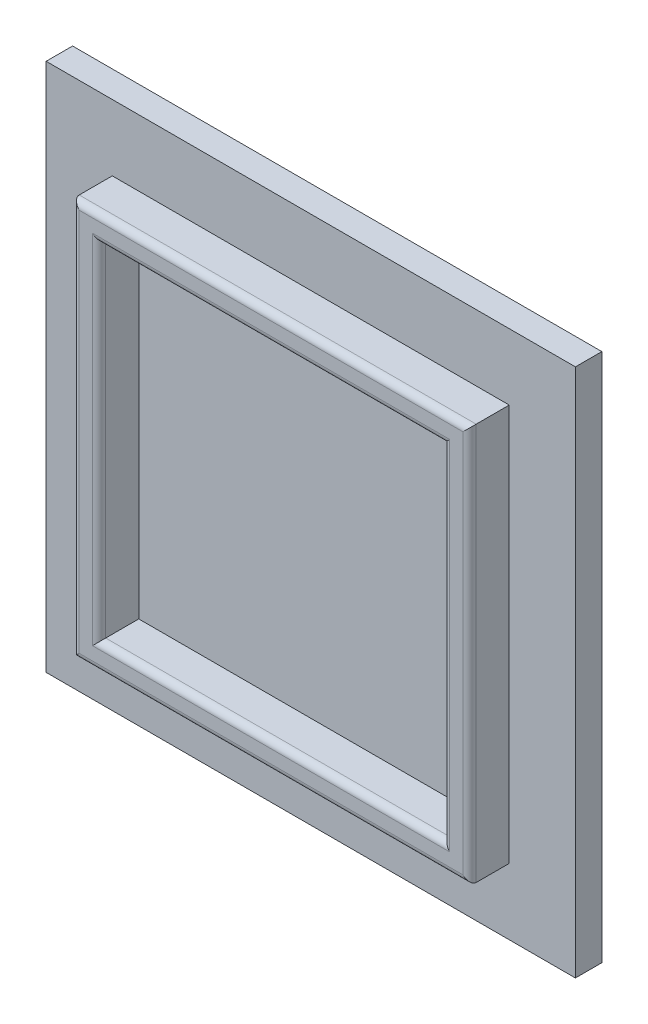
ISO-10303-21;
HEADER;
FILE_DESCRIPTION(('STEP AP214'),'2;1');
FILE_NAME('part.step','',(''),(''),'','','');
FILE_SCHEMA(('AUTOMOTIVE_DESIGN { 1 0 10303 214 1 1 1 1 }'));
ENDSEC;
DATA;
#1=APPLICATION_CONTEXT('core data for automotive mechanical design processes');
#2=APPLICATION_PROTOCOL_DEFINITION('international standard','automotive_design',2000,#1);
#3=PRODUCT_CONTEXT('',#1,'mechanical');
#4=PRODUCT('Part','Part','',(#3));
#5=PRODUCT_RELATED_PRODUCT_CATEGORY('part','',(#4));
#6=PRODUCT_DEFINITION_FORMATION('','',#4);
#7=PRODUCT_DEFINITION_CONTEXT('part definition',#1,'design');
#8=PRODUCT_DEFINITION('design','',#6,#7);
#9=PRODUCT_DEFINITION_SHAPE('','',#8);
#10=(LENGTH_UNIT() NAMED_UNIT(*) SI_UNIT(.MILLI.,.METRE.));
#11=(NAMED_UNIT(*) PLANE_ANGLE_UNIT() SI_UNIT($,.RADIAN.));
#12=(NAMED_UNIT(*) SI_UNIT($,.STERADIAN.) SOLID_ANGLE_UNIT());
#13=UNCERTAINTY_MEASURE_WITH_UNIT(LENGTH_MEASURE(1.E-05),#10,'distance_accuracy_value','');
#14=(GEOMETRIC_REPRESENTATION_CONTEXT(3) GLOBAL_UNCERTAINTY_ASSIGNED_CONTEXT((#13)) GLOBAL_UNIT_ASSIGNED_CONTEXT((#10,
#11,#12)) REPRESENTATION_CONTEXT('',''));
#15=CARTESIAN_POINT('',(0.,0.,0.));
#16=DIRECTION('',(0.,0.,1.));
#17=DIRECTION('',(1.,0.,0.));
#18=AXIS2_PLACEMENT_3D('',#15,#16,#17);
#19=CARTESIAN_POINT('',(0.,0.,2.));
#20=DIRECTION('',(0.,0.,1.));
#21=DIRECTION('',(1.,0.,0.));
#22=AXIS2_PLACEMENT_3D('',#19,#20,#21);
#23=PLANE('',#22);
#24=DIRECTION('',(0.,-1.,0.));
#25=VECTOR('',#24,1.);
#26=CARTESIAN_POINT('',(-25.1923076923077,15.1442307692308,2.));
#27=LINE('',#26,#25);
#28=CARTESIAN_POINT('',(-25.1923076923077,15.1442307692308,2.));
#29=VERTEX_POINT('',#28);
#30=CARTESIAN_POINT('',(-25.1923076923077,-24.8557692307692,2.));
#31=VERTEX_POINT('',#30);
#32=EDGE_CURVE('E217',#29,#31,#27,.T.);
#33=ORIENTED_EDGE('',*,*,#32,.T.);
#34=DIRECTION('',(1.,0.,0.));
#35=VECTOR('',#34,1.);
#36=CARTESIAN_POINT('',(-25.1923076923077,-24.8557692307692,2.));
#37=LINE('',#36,#35);
#38=CARTESIAN_POINT('',(14.8076923076923,-24.8557692307692,2.));
#39=VERTEX_POINT('',#38);
#40=EDGE_CURVE('E221',#31,#39,#37,.T.);
#41=ORIENTED_EDGE('',*,*,#40,.T.);
#42=DIRECTION('',(0.,1.,0.));
#43=VECTOR('',#42,1.);
#44=CARTESIAN_POINT('',(14.8076923076923,15.1442307692308,2.));
#45=LINE('',#44,#43);
#46=CARTESIAN_POINT('',(14.8076923076923,15.1442307692308,2.));
#47=VERTEX_POINT('',#46);
#48=EDGE_CURVE('E225',#39,#47,#45,.T.);
#49=ORIENTED_EDGE('',*,*,#48,.T.);
#50=DIRECTION('',(-1.,0.,0.));
#51=VECTOR('',#50,1.);
#52=CARTESIAN_POINT('',(-25.1923076923077,15.1442307692308,2.));
#53=LINE('',#52,#51);
#54=EDGE_CURVE('E228',#47,#29,#53,.T.);
#55=ORIENTED_EDGE('',*,*,#54,.T.);
#56=EDGE_LOOP('',(#33,#41,#49,#55));
#57=FACE_BOUND('',#56,.T.);
#58=DIRECTION('',(1.,0.,0.));
#59=VECTOR('',#58,1.);
#60=CARTESIAN_POINT('',(9.80769230769232,-19.8557692307691,2.));
#61=LINE('',#60,#59);
#62=CARTESIAN_POINT('',(-20.1923076923077,-19.8557692307691,2.));
#63=VERTEX_POINT('',#62);
#64=CARTESIAN_POINT('',(9.80769230769232,-19.8557692307691,2.));
#65=VERTEX_POINT('',#64);
#66=EDGE_CURVE('E192',#63,#65,#61,.T.);
#67=ORIENTED_EDGE('',*,*,#66,.F.);
#68=DIRECTION('',(0.,-1.,0.));
#69=VECTOR('',#68,1.);
#70=CARTESIAN_POINT('',(-20.1923076923077,-19.8557692307691,2.));
#71=LINE('',#70,#69);
#72=CARTESIAN_POINT('',(-20.1923076923077,10.1442307692307,2.));
#73=VERTEX_POINT('',#72);
#74=EDGE_CURVE('E188',#73,#63,#71,.T.);
#75=ORIENTED_EDGE('',*,*,#74,.F.);
#76=DIRECTION('',(-1.,0.,0.));
#77=VECTOR('',#76,1.);
#78=CARTESIAN_POINT('',(9.80769230769232,10.1442307692307,2.));
#79=LINE('',#78,#77);
#80=CARTESIAN_POINT('',(9.80769230769232,10.1442307692307,2.));
#81=VERTEX_POINT('',#80);
#82=EDGE_CURVE('E200',#81,#73,#79,.T.);
#83=ORIENTED_EDGE('',*,*,#82,.F.);
#84=DIRECTION('',(0.,1.,0.));
#85=VECTOR('',#84,1.);
#86=CARTESIAN_POINT('',(9.80769230769232,-19.8557692307691,2.));
#87=LINE('',#86,#85);
#88=EDGE_CURVE('E196',#65,#81,#87,.T.);
#89=ORIENTED_EDGE('',*,*,#88,.F.);
#90=EDGE_LOOP('',(#67,#75,#83,#89));
#91=FACE_BOUND('',#90,.T.);
#92=ADVANCED_FACE('F38',(#57,#91),#23,.T.);
#93=CARTESIAN_POINT('',(-25.1923076923077,15.1442307692308,2.));
#94=DIRECTION('',(1.,0.,0.));
#95=DIRECTION('',(0.,1.,0.));
#96=AXIS2_PLACEMENT_3D('',#93,#94,#95);
#97=PLANE('',#96);
#98=DIRECTION('',(0.,-1.,0.));
#99=VECTOR('',#98,1.);
#100=CARTESIAN_POINT('',(-25.1923076923077,15.1442307692308,0.));
#101=LINE('',#100,#99);
#102=CARTESIAN_POINT('',(-25.1923076923077,15.1442307692308,0.));
#103=VERTEX_POINT('',#102);
#104=CARTESIAN_POINT('',(-25.1923076923077,-24.8557692307692,0.));
#105=VERTEX_POINT('',#104);
#106=EDGE_CURVE('E216',#103,#105,#101,.T.);
#107=ORIENTED_EDGE('',*,*,#106,.T.);
#108=DIRECTION('',(0.,0.,-1.));
#109=VECTOR('',#108,1.);
#110=CARTESIAN_POINT('',(-25.1923076923077,-24.8557692307692,2.));
#111=LINE('',#110,#109);
#112=EDGE_CURVE('E254',#31,#105,#111,.T.);
#113=ORIENTED_EDGE('',*,*,#112,.F.);
#114=ORIENTED_EDGE('',*,*,#32,.F.);
#115=DIRECTION('',(0.,0.,-1.));
#116=VECTOR('',#115,1.);
#117=CARTESIAN_POINT('',(-25.1923076923077,15.1442307692308,2.));
#118=LINE('',#117,#116);
#119=EDGE_CURVE('E231',#29,#103,#118,.T.);
#120=ORIENTED_EDGE('',*,*,#119,.T.);
#121=EDGE_LOOP('',(#107,#113,#114,#120));
#122=FACE_BOUND('',#121,.T.);
#123=ADVANCED_FACE('F370',(#122),#97,.F.);
#124=CARTESIAN_POINT('',(-25.1923076923077,-24.8557692307692,2.));
#125=DIRECTION('',(0.,1.,0.));
#126=DIRECTION('',(0.,0.,1.));
#127=AXIS2_PLACEMENT_3D('',#124,#125,#126);
#128=PLANE('',#127);
#129=DIRECTION('',(1.,0.,0.));
#130=VECTOR('',#129,1.);
#131=CARTESIAN_POINT('',(-25.1923076923077,-24.8557692307692,0.));
#132=LINE('',#131,#130);
#133=CARTESIAN_POINT('',(14.8076923076923,-24.8557692307692,0.));
#134=VERTEX_POINT('',#133);
#135=EDGE_CURVE('E235',#105,#134,#132,.T.);
#136=ORIENTED_EDGE('',*,*,#135,.T.);
#137=DIRECTION('',(0.,0.,-1.));
#138=VECTOR('',#137,1.);
#139=CARTESIAN_POINT('',(14.8076923076923,-24.8557692307692,2.));
#140=LINE('',#139,#138);
#141=EDGE_CURVE('E250',#39,#134,#140,.T.);
#142=ORIENTED_EDGE('',*,*,#141,.F.);
#143=ORIENTED_EDGE('',*,*,#40,.F.);
#144=ORIENTED_EDGE('',*,*,#112,.T.);
#145=EDGE_LOOP('',(#136,#142,#143,#144));
#146=FACE_BOUND('',#145,.T.);
#147=ADVANCED_FACE('F378',(#146),#128,.F.);
#148=CARTESIAN_POINT('',(14.8076923076923,15.1442307692308,2.));
#149=DIRECTION('',(-1.,0.,0.));
#150=DIRECTION('',(0.,-1.,0.));
#151=AXIS2_PLACEMENT_3D('',#148,#149,#150);
#152=PLANE('',#151);
#153=DIRECTION('',(0.,1.,0.));
#154=VECTOR('',#153,1.);
#155=CARTESIAN_POINT('',(14.8076923076923,15.1442307692308,0.));
#156=LINE('',#155,#154);
#157=CARTESIAN_POINT('',(14.8076923076923,15.1442307692308,0.));
#158=VERTEX_POINT('',#157);
#159=EDGE_CURVE('E238',#134,#158,#156,.T.);
#160=ORIENTED_EDGE('',*,*,#159,.T.);
#161=DIRECTION('',(0.,0.,-1.));
#162=VECTOR('',#161,1.);
#163=CARTESIAN_POINT('',(14.8076923076923,15.1442307692308,2.));
#164=LINE('',#163,#162);
#165=EDGE_CURVE('E246',#47,#158,#164,.T.);
#166=ORIENTED_EDGE('',*,*,#165,.F.);
#167=ORIENTED_EDGE('',*,*,#48,.F.);
#168=ORIENTED_EDGE('',*,*,#141,.T.);
#169=EDGE_LOOP('',(#160,#166,#167,#168));
#170=FACE_BOUND('',#169,.T.);
#171=ADVANCED_FACE('F472',(#170),#152,.F.);
#172=CARTESIAN_POINT('',(-25.1923076923077,15.1442307692308,2.));
#173=DIRECTION('',(0.,-1.,0.));
#174=DIRECTION('',(0.,0.,-1.));
#175=AXIS2_PLACEMENT_3D('',#172,#173,#174);
#176=PLANE('',#175);
#177=DIRECTION('',(-1.,0.,0.));
#178=VECTOR('',#177,1.);
#179=CARTESIAN_POINT('',(-25.1923076923077,15.1442307692308,0.));
#180=LINE('',#179,#178);
#181=EDGE_CURVE('E222',#158,#103,#180,.T.);
#182=ORIENTED_EDGE('',*,*,#181,.T.);
#183=ORIENTED_EDGE('',*,*,#119,.F.);
#184=ORIENTED_EDGE('',*,*,#54,.F.);
#185=ORIENTED_EDGE('',*,*,#165,.T.);
#186=EDGE_LOOP('',(#182,#183,#184,#185));
#187=FACE_BOUND('',#186,.T.);
#188=ADVANCED_FACE('F460',(#187),#176,.F.);
#189=CARTESIAN_POINT('',(0.,0.,0.));
#190=DIRECTION('',(0.,0.,1.));
#191=DIRECTION('',(1.,0.,0.));
#192=AXIS2_PLACEMENT_3D('',#189,#190,#191);
#193=PLANE('',#192);
#194=ORIENTED_EDGE('',*,*,#106,.F.);
#195=ORIENTED_EDGE('',*,*,#181,.F.);
#196=ORIENTED_EDGE('',*,*,#159,.F.);
#197=ORIENTED_EDGE('',*,*,#135,.F.);
#198=EDGE_LOOP('',(#194,#195,#196,#197));
#199=FACE_BOUND('',#198,.T.);
#200=ADVANCED_FACE('F449',(#199),#193,.F.);
#201=CARTESIAN_POINT('',(0.,0.,5.));
#202=DIRECTION('',(0.,0.,1.));
#203=DIRECTION('',(1.,0.,0.));
#204=AXIS2_PLACEMENT_3D('',#201,#202,#203);
#205=PLANE('',#204);
#206=DIRECTION('',(0.,1.,0.));
#207=VECTOR('',#206,1.);
#208=CARTESIAN_POINT('',(8.3076923076923,0.,5.));
#209=LINE('',#208,#207);
#210=CARTESIAN_POINT('',(8.3076923076923,8.64423076923077,5.));
#211=VERTEX_POINT('',#210);
#212=CARTESIAN_POINT('',(8.3076923076923,-18.3557692307692,5.));
#213=VERTEX_POINT('',#212);
#214=EDGE_CURVE('E277',#211,#213,#209,.F.);
#215=ORIENTED_EDGE('',*,*,#214,.T.);
#216=DIRECTION('',(1.,0.,0.));
#217=VECTOR('',#216,1.);
#218=CARTESIAN_POINT('',(0.,-18.3557692307692,5.));
#219=LINE('',#218,#217);
#220=CARTESIAN_POINT('',(-18.6923076923077,-18.3557692307692,5.));
#221=VERTEX_POINT('',#220);
#222=EDGE_CURVE('E280',#213,#221,#219,.F.);
#223=ORIENTED_EDGE('',*,*,#222,.T.);
#224=DIRECTION('',(0.,-1.,0.));
#225=VECTOR('',#224,1.);
#226=CARTESIAN_POINT('',(-18.6923076923077,0.,5.));
#227=LINE('',#226,#225);
#228=CARTESIAN_POINT('',(-18.6923076923077,8.64423076923077,5.));
#229=VERTEX_POINT('',#228);
#230=EDGE_CURVE('E274',#221,#229,#227,.F.);
#231=ORIENTED_EDGE('',*,*,#230,.T.);
#232=DIRECTION('',(-1.,0.,0.));
#233=VECTOR('',#232,1.);
#234=CARTESIAN_POINT('',(0.,8.64423076923077,5.));
#235=LINE('',#234,#233);
#236=EDGE_CURVE('E271',#229,#211,#235,.F.);
#237=ORIENTED_EDGE('',*,*,#236,.T.);
#238=EDGE_LOOP('',(#215,#223,#231,#237));
#239=FACE_BOUND('',#238,.T.);
#240=DIRECTION('',(0.,-1.,0.));
#241=VECTOR('',#240,1.);
#242=CARTESIAN_POINT('',(-19.6923076923077,-19.8557692307691,5.));
#243=LINE('',#242,#241);
#244=CARTESIAN_POINT('',(-19.6923076923077,9.6442307692307,5.));
#245=VERTEX_POINT('',#244);
#246=CARTESIAN_POINT('',(-19.6923076923077,-19.3557692307691,5.));
#247=VERTEX_POINT('',#246);
#248=EDGE_CURVE('E258',#245,#247,#243,.T.);
#249=ORIENTED_EDGE('',*,*,#248,.T.);
#250=DIRECTION('',(1.,0.,0.));
#251=VECTOR('',#250,1.);
#252=CARTESIAN_POINT('',(9.80769230769232,-19.3557692307691,5.));
#253=LINE('',#252,#251);
#254=CARTESIAN_POINT('',(9.30769230769232,-19.3557692307691,5.));
#255=VERTEX_POINT('',#254);
#256=EDGE_CURVE('E267',#247,#255,#253,.T.);
#257=ORIENTED_EDGE('',*,*,#256,.T.);
#258=DIRECTION('',(0.,1.,0.));
#259=VECTOR('',#258,1.);
#260=CARTESIAN_POINT('',(9.30769230769232,10.1442307692307,5.));
#261=LINE('',#260,#259);
#262=CARTESIAN_POINT('',(9.30769230769232,9.64423076923069,5.));
#263=VERTEX_POINT('',#262);
#264=EDGE_CURVE('E264',#255,#263,#261,.T.);
#265=ORIENTED_EDGE('',*,*,#264,.T.);
#266=DIRECTION('',(-1.,0.,0.));
#267=VECTOR('',#266,1.);
#268=CARTESIAN_POINT('',(-20.1923076923077,9.6442307692307,5.));
#269=LINE('',#268,#267);
#270=EDGE_CURVE('E261',#263,#245,#269,.T.);
#271=ORIENTED_EDGE('',*,*,#270,.T.);
#272=EDGE_LOOP('',(#249,#257,#265,#271));
#273=FACE_BOUND('',#272,.T.);
#274=ADVANCED_FACE('F341',(#239,#273),#205,.T.);
#275=CARTESIAN_POINT('',(-20.1923076923077,-19.8557692307691,5.));
#276=DIRECTION('',(1.,0.,0.));
#277=DIRECTION('',(0.,1.,0.));
#278=AXIS2_PLACEMENT_3D('',#275,#276,#277);
#279=PLANE('',#278);
#280=DIRECTION('',(0.,0.,-1.));
#281=VECTOR('',#280,1.);
#282=CARTESIAN_POINT('',(-20.1923076923077,-19.8557692307691,5.));
#283=LINE('',#282,#281);
#284=CARTESIAN_POINT('',(-20.1923076923077,-19.8557692307691,4.5));
#285=VERTEX_POINT('',#284);
#286=EDGE_CURVE('E213',#285,#63,#283,.T.);
#287=ORIENTED_EDGE('',*,*,#286,.F.);
#288=DIRECTION('',(0.,-1.,0.));
#289=VECTOR('',#288,1.);
#290=CARTESIAN_POINT('',(-20.1923076923077,10.1442307692307,4.5));
#291=LINE('',#290,#289);
#292=CARTESIAN_POINT('',(-20.1923076923077,10.1442307692307,4.5));
#293=VERTEX_POINT('',#292);
#294=EDGE_CURVE('E11',#285,#293,#291,.F.);
#295=ORIENTED_EDGE('',*,*,#294,.T.);
#296=DIRECTION('',(0.,0.,-1.));
#297=VECTOR('',#296,1.);
#298=CARTESIAN_POINT('',(-20.1923076923077,10.1442307692307,5.));
#299=LINE('',#298,#297);
#300=EDGE_CURVE('E204',#293,#73,#299,.T.);
#301=ORIENTED_EDGE('',*,*,#300,.T.);
#302=ORIENTED_EDGE('',*,*,#74,.T.);
#303=EDGE_LOOP('',(#287,#295,#301,#302));
#304=FACE_BOUND('',#303,.T.);
#305=ADVANCED_FACE('F434',(#304),#279,.F.);
#306=CARTESIAN_POINT('',(9.80769230769232,-19.8557692307691,5.));
#307=DIRECTION('',(0.,1.,0.));
#308=DIRECTION('',(-1.,0.,0.));
#309=AXIS2_PLACEMENT_3D('',#306,#307,#308);
#310=PLANE('',#309);
#311=DIRECTION('',(0.,0.,-1.));
#312=VECTOR('',#311,1.);
#313=CARTESIAN_POINT('',(9.80769230769232,-19.8557692307691,5.));
#314=LINE('',#313,#312);
#315=CARTESIAN_POINT('',(9.80769230769232,-19.8557692307691,4.5));
#316=VERTEX_POINT('',#315);
#317=EDGE_CURVE('E210',#316,#65,#314,.T.);
#318=ORIENTED_EDGE('',*,*,#317,.F.);
#319=DIRECTION('',(1.,0.,0.));
#320=VECTOR('',#319,1.);
#321=CARTESIAN_POINT('',(-20.1923076923077,-19.8557692307691,4.5));
#322=LINE('',#321,#320);
#323=EDGE_CURVE('E284',#316,#285,#322,.F.);
#324=ORIENTED_EDGE('',*,*,#323,.T.);
#325=ORIENTED_EDGE('',*,*,#286,.T.);
#326=ORIENTED_EDGE('',*,*,#66,.T.);
#327=EDGE_LOOP('',(#318,#324,#325,#326));
#328=FACE_BOUND('',#327,.T.);
#329=ADVANCED_FACE('F424',(#328),#310,.F.);
#330=CARTESIAN_POINT('',(9.80769230769232,-19.8557692307691,5.));
#331=DIRECTION('',(-1.,0.,0.));
#332=DIRECTION('',(0.,-1.,0.));
#333=AXIS2_PLACEMENT_3D('',#330,#331,#332);
#334=PLANE('',#333);
#335=DIRECTION('',(0.,0.,-1.));
#336=VECTOR('',#335,1.);
#337=CARTESIAN_POINT('',(9.80769230769232,10.1442307692307,5.));
#338=LINE('',#337,#336);
#339=CARTESIAN_POINT('',(9.80769230769232,10.1442307692307,4.5));
#340=VERTEX_POINT('',#339);
#341=EDGE_CURVE('E207',#340,#81,#338,.T.);
#342=ORIENTED_EDGE('',*,*,#341,.F.);
#343=DIRECTION('',(0.,1.,0.));
#344=VECTOR('',#343,1.);
#345=CARTESIAN_POINT('',(9.80769230769232,-19.8557692307691,4.5));
#346=LINE('',#345,#344);
#347=EDGE_CURVE('E294',#340,#316,#346,.F.);
#348=ORIENTED_EDGE('',*,*,#347,.T.);
#349=ORIENTED_EDGE('',*,*,#317,.T.);
#350=ORIENTED_EDGE('',*,*,#88,.T.);
#351=EDGE_LOOP('',(#342,#348,#349,#350));
#352=FACE_BOUND('',#351,.T.);
#353=ADVANCED_FACE('F365',(#352),#334,.F.);
#354=CARTESIAN_POINT('',(9.80769230769232,10.1442307692307,5.));
#355=DIRECTION('',(0.,-1.,0.));
#356=DIRECTION('',(1.,0.,0.));
#357=AXIS2_PLACEMENT_3D('',#354,#355,#356);
#358=PLANE('',#357);
#359=ORIENTED_EDGE('',*,*,#300,.F.);
#360=DIRECTION('',(-1.,0.,0.));
#361=VECTOR('',#360,1.);
#362=CARTESIAN_POINT('',(9.80769230769232,10.1442307692307,4.5));
#363=LINE('',#362,#361);
#364=EDGE_CURVE('E48',#293,#340,#363,.F.);
#365=ORIENTED_EDGE('',*,*,#364,.T.);
#366=ORIENTED_EDGE('',*,*,#341,.T.);
#367=ORIENTED_EDGE('',*,*,#82,.T.);
#368=EDGE_LOOP('',(#359,#365,#366,#367));
#369=FACE_BOUND('',#368,.T.);
#370=ADVANCED_FACE('F358',(#369),#358,.F.);
#371=CARTESIAN_POINT('',(-18.1923076923077,-17.8557692307692,5.));
#372=DIRECTION('',(1.,0.,0.));
#373=DIRECTION('',(0.,0.,-1.));
#374=AXIS2_PLACEMENT_3D('',#371,#372,#373);
#375=PLANE('',#374);
#376=DIRECTION('',(0.,0.,-1.));
#377=VECTOR('',#376,1.);
#378=CARTESIAN_POINT('',(-18.1923076923077,8.14423076923077,5.));
#379=LINE('',#378,#377);
#380=CARTESIAN_POINT('',(-18.1923076923077,8.14423076923077,4.5));
#381=VERTEX_POINT('',#380);
#382=CARTESIAN_POINT('',(-18.1923076923077,8.14423076923077,2.));
#383=VERTEX_POINT('',#382);
#384=EDGE_CURVE('E163',#381,#383,#379,.T.);
#385=ORIENTED_EDGE('',*,*,#384,.F.);
#386=DIRECTION('',(0.,-1.,0.));
#387=VECTOR('',#386,1.);
#388=CARTESIAN_POINT('',(-18.1923076923077,-17.8557692307692,4.5));
#389=LINE('',#388,#387);
#390=CARTESIAN_POINT('',(-18.1923076923077,-17.8557692307692,4.5));
#391=VERTEX_POINT('',#390);
#392=EDGE_CURVE('E297',#381,#391,#389,.T.);
#393=ORIENTED_EDGE('',*,*,#392,.T.);
#394=DIRECTION('',(0.,0.,-1.));
#395=VECTOR('',#394,1.);
#396=CARTESIAN_POINT('',(-18.1923076923077,-17.8557692307692,5.));
#397=LINE('',#396,#395);
#398=CARTESIAN_POINT('',(-18.1923076923077,-17.8557692307692,2.));
#399=VERTEX_POINT('',#398);
#400=EDGE_CURVE('E185',#391,#399,#397,.T.);
#401=ORIENTED_EDGE('',*,*,#400,.T.);
#402=DIRECTION('',(0.,-1.,0.));
#403=VECTOR('',#402,1.);
#404=CARTESIAN_POINT('',(-18.1923076923077,-17.8557692307692,2.));
#405=LINE('',#404,#403);
#406=EDGE_CURVE('E318',#383,#399,#405,.T.);
#407=ORIENTED_EDGE('',*,*,#406,.F.);
#408=EDGE_LOOP('',(#385,#393,#401,#407));
#409=FACE_BOUND('',#408,.T.);
#410=ADVANCED_FACE('F353',(#409),#375,.T.);
#411=CARTESIAN_POINT('',(7.8076923076923,-17.8557692307692,5.));
#412=DIRECTION('',(0.,1.,0.));
#413=DIRECTION('',(0.,0.,1.));
#414=AXIS2_PLACEMENT_3D('',#411,#412,#413);
#415=PLANE('',#414);
#416=ORIENTED_EDGE('',*,*,#400,.F.);
#417=DIRECTION('',(1.,0.,0.));
#418=VECTOR('',#417,1.);
#419=CARTESIAN_POINT('',(7.8076923076923,-17.8557692307692,4.5));
#420=LINE('',#419,#418);
#421=CARTESIAN_POINT('',(7.8076923076923,-17.8557692307692,4.5));
#422=VERTEX_POINT('',#421);
#423=EDGE_CURVE('E288',#391,#422,#420,.T.);
#424=ORIENTED_EDGE('',*,*,#423,.T.);
#425=DIRECTION('',(0.,0.,-1.));
#426=VECTOR('',#425,1.);
#427=CARTESIAN_POINT('',(7.8076923076923,-17.8557692307692,5.));
#428=LINE('',#427,#426);
#429=CARTESIAN_POINT('',(7.8076923076923,-17.8557692307692,2.));
#430=VERTEX_POINT('',#429);
#431=EDGE_CURVE('E162',#422,#430,#428,.T.);
#432=ORIENTED_EDGE('',*,*,#431,.T.);
#433=DIRECTION('',(1.,0.,0.));
#434=VECTOR('',#433,1.);
#435=CARTESIAN_POINT('',(7.8076923076923,-17.8557692307692,2.));
#436=LINE('',#435,#434);
#437=EDGE_CURVE('E173',#399,#430,#436,.T.);
#438=ORIENTED_EDGE('',*,*,#437,.F.);
#439=EDGE_LOOP('',(#416,#424,#432,#438));
#440=FACE_BOUND('',#439,.T.);
#441=ADVANCED_FACE('F351',(#440),#415,.T.);
#442=CARTESIAN_POINT('',(7.8076923076923,-17.8557692307692,5.));
#443=DIRECTION('',(-1.,0.,0.));
#444=DIRECTION('',(0.,0.,1.));
#445=AXIS2_PLACEMENT_3D('',#442,#443,#444);
#446=PLANE('',#445);
#447=ORIENTED_EDGE('',*,*,#431,.F.);
#448=DIRECTION('',(0.,1.,0.));
#449=VECTOR('',#448,1.);
#450=CARTESIAN_POINT('',(7.8076923076923,-17.8557692307692,4.5));
#451=LINE('',#450,#449);
#452=CARTESIAN_POINT('',(7.8076923076923,8.14423076923077,4.5));
#453=VERTEX_POINT('',#452);
#454=EDGE_CURVE('E159',#422,#453,#451,.T.);
#455=ORIENTED_EDGE('',*,*,#454,.T.);
#456=DIRECTION('',(0.,0.,-1.));
#457=VECTOR('',#456,1.);
#458=CARTESIAN_POINT('',(7.8076923076923,8.14423076923077,5.));
#459=LINE('',#458,#457);
#460=CARTESIAN_POINT('',(7.8076923076923,8.14423076923077,2.));
#461=VERTEX_POINT('',#460);
#462=EDGE_CURVE('E153',#453,#461,#459,.T.);
#463=ORIENTED_EDGE('',*,*,#462,.T.);
#464=DIRECTION('',(0.,1.,0.));
#465=VECTOR('',#464,1.);
#466=CARTESIAN_POINT('',(7.8076923076923,-17.8557692307692,2.));
#467=LINE('',#466,#465);
#468=EDGE_CURVE('E157',#430,#461,#467,.T.);
#469=ORIENTED_EDGE('',*,*,#468,.F.);
#470=EDGE_LOOP('',(#447,#455,#463,#469));
#471=FACE_BOUND('',#470,.T.);
#472=ADVANCED_FACE('F156',(#471),#446,.T.);
#473=CARTESIAN_POINT('',(7.8076923076923,8.14423076923077,5.));
#474=DIRECTION('',(0.,-1.,0.));
#475=DIRECTION('',(0.,0.,-1.));
#476=AXIS2_PLACEMENT_3D('',#473,#474,#475);
#477=PLANE('',#476);
#478=ORIENTED_EDGE('',*,*,#462,.F.);
#479=DIRECTION('',(-1.,0.,0.));
#480=VECTOR('',#479,1.);
#481=CARTESIAN_POINT('',(7.8076923076923,8.14423076923077,4.5));
#482=LINE('',#481,#480);
#483=EDGE_CURVE('E62',#453,#381,#482,.T.);
#484=ORIENTED_EDGE('',*,*,#483,.T.);
#485=ORIENTED_EDGE('',*,*,#384,.T.);
#486=DIRECTION('',(-1.,0.,0.));
#487=VECTOR('',#486,1.);
#488=CARTESIAN_POINT('',(7.8076923076923,8.14423076923077,2.));
#489=LINE('',#488,#487);
#490=EDGE_CURVE('E170',#461,#383,#489,.T.);
#491=ORIENTED_EDGE('',*,*,#490,.F.);
#492=EDGE_LOOP('',(#478,#484,#485,#491));
#493=FACE_BOUND('',#492,.T.);
#494=ADVANCED_FACE('F176',(#493),#477,.T.);
#495=ORIENTED_EDGE('',*,*,#406,.T.);
#496=ORIENTED_EDGE('',*,*,#437,.T.);
#497=ORIENTED_EDGE('',*,*,#468,.T.);
#498=ORIENTED_EDGE('',*,*,#490,.T.);
#499=EDGE_LOOP('',(#495,#496,#497,#498));
#500=FACE_BOUND('',#499,.T.);
#501=ADVANCED_FACE('F169',(#500),#23,.T.);
#502=CARTESIAN_POINT('',(0.,9.64423076923069,4.5));
#503=DIRECTION('',(1.,0.,0.));
#504=DIRECTION('',(0.,1.,0.));
#505=AXIS2_PLACEMENT_3D('',#502,#503,#504);
#506=CYLINDRICAL_SURFACE('',#505,0.5);
#507=CARTESIAN_POINT('',(9.30769230769232,9.64423076923069,4.5));
#508=DIRECTION('',(0.707106781186547,-0.707106781186547,0.));
#509=DIRECTION('',(0.707106781186547,0.707106781186547,0.));
#510=AXIS2_PLACEMENT_3D('',#507,#508,#509);
#511=ELLIPSE('',#510,0.707106781186547,0.5);
#512=EDGE_CURVE('E310',#340,#263,#511,.T.);
#513=ORIENTED_EDGE('',*,*,#512,.F.);
#514=ORIENTED_EDGE('',*,*,#364,.F.);
#515=CARTESIAN_POINT('',(-19.6923076923077,9.6442307692307,4.5));
#516=DIRECTION('',(0.707106781186548,0.707106781186547,0.));
#517=DIRECTION('',(-0.707106781186547,0.707106781186548,0.));
#518=AXIS2_PLACEMENT_3D('',#515,#516,#517);
#519=ELLIPSE('',#518,0.707106781186547,0.5);
#520=EDGE_CURVE('E314',#245,#293,#519,.F.);
#521=ORIENTED_EDGE('',*,*,#520,.F.);
#522=ORIENTED_EDGE('',*,*,#270,.F.);
#523=EDGE_LOOP('',(#513,#514,#521,#522));
#524=FACE_BOUND('',#523,.T.);
#525=ADVANCED_FACE('F384',(#524),#506,.T.);
#526=CARTESIAN_POINT('',(-19.6923076923077,0.,4.5));
#527=DIRECTION('',(0.,1.,0.));
#528=DIRECTION('',(-1.,0.,0.));
#529=AXIS2_PLACEMENT_3D('',#526,#527,#528);
#530=CYLINDRICAL_SURFACE('',#529,0.5);
#531=ORIENTED_EDGE('',*,*,#520,.T.);
#532=ORIENTED_EDGE('',*,*,#294,.F.);
#533=CARTESIAN_POINT('',(-19.6923076923077,-19.3557692307691,4.5));
#534=DIRECTION('',(-0.707106781186547,0.707106781186548,0.));
#535=DIRECTION('',(0.707106781186548,0.707106781186547,0.));
#536=AXIS2_PLACEMENT_3D('',#533,#534,#535);
#537=ELLIPSE('',#536,0.707106781186548,0.5);
#538=EDGE_CURVE('E307',#247,#285,#537,.F.);
#539=ORIENTED_EDGE('',*,*,#538,.F.);
#540=ORIENTED_EDGE('',*,*,#248,.F.);
#541=EDGE_LOOP('',(#531,#532,#539,#540));
#542=FACE_BOUND('',#541,.T.);
#543=ADVANCED_FACE('F389',(#542),#530,.T.);
#544=CARTESIAN_POINT('',(9.30769230769232,0.,4.5));
#545=DIRECTION('',(0.,-1.,0.));
#546=DIRECTION('',(1.,0.,0.));
#547=AXIS2_PLACEMENT_3D('',#544,#545,#546);
#548=CYLINDRICAL_SURFACE('',#547,0.5);
#549=ORIENTED_EDGE('',*,*,#512,.T.);
#550=ORIENTED_EDGE('',*,*,#264,.F.);
#551=CARTESIAN_POINT('',(9.30769230769232,-19.3557692307691,4.5));
#552=DIRECTION('',(-0.707106781186547,-0.707106781186547,0.));
#553=DIRECTION('',(0.707106781186547,-0.707106781186547,0.));
#554=AXIS2_PLACEMENT_3D('',#551,#552,#553);
#555=ELLIPSE('',#554,0.707106781186548,0.5);
#556=EDGE_CURVE('E304',#316,#255,#555,.T.);
#557=ORIENTED_EDGE('',*,*,#556,.F.);
#558=ORIENTED_EDGE('',*,*,#347,.F.);
#559=EDGE_LOOP('',(#549,#550,#557,#558));
#560=FACE_BOUND('',#559,.T.);
#561=ADVANCED_FACE('F505',(#560),#548,.T.);
#562=CARTESIAN_POINT('',(0.,-19.3557692307691,4.5));
#563=DIRECTION('',(-1.,0.,0.));
#564=DIRECTION('',(0.,-1.,0.));
#565=AXIS2_PLACEMENT_3D('',#562,#563,#564);
#566=CYLINDRICAL_SURFACE('',#565,0.5);
#567=ORIENTED_EDGE('',*,*,#538,.T.);
#568=ORIENTED_EDGE('',*,*,#323,.F.);
#569=ORIENTED_EDGE('',*,*,#556,.T.);
#570=ORIENTED_EDGE('',*,*,#256,.F.);
#571=EDGE_LOOP('',(#567,#568,#569,#570));
#572=FACE_BOUND('',#571,.T.);
#573=ADVANCED_FACE('F502',(#572),#566,.T.);
#574=CARTESIAN_POINT('',(7.8076923076923,8.64423076923077,4.5));
#575=DIRECTION('',(-1.,0.,0.));
#576=DIRECTION('',(0.,0.,1.));
#577=AXIS2_PLACEMENT_3D('',#574,#575,#576);
#578=CYLINDRICAL_SURFACE('',#577,0.5);
#579=CARTESIAN_POINT('',(8.3076923076923,8.64423076923077,4.5));
#580=DIRECTION('',(-0.707106781186547,0.707106781186547,0.));
#581=DIRECTION('',(0.707106781186547,0.707106781186547,0.));
#582=AXIS2_PLACEMENT_3D('',#579,#580,#581);
#583=ELLIPSE('',#582,0.707106781186547,0.5);
#584=EDGE_CURVE('E324',#211,#453,#583,.F.);
#585=ORIENTED_EDGE('',*,*,#584,.F.);
#586=ORIENTED_EDGE('',*,*,#236,.F.);
#587=CARTESIAN_POINT('',(-18.6923076923077,8.64423076923077,4.5));
#588=DIRECTION('',(-0.707106781186547,-0.707106781186547,0.));
#589=DIRECTION('',(0.707106781186547,-0.707106781186547,0.));
#590=AXIS2_PLACEMENT_3D('',#587,#588,#589);
#591=ELLIPSE('',#590,0.707106781186547,0.5);
#592=EDGE_CURVE('E42',#381,#229,#591,.T.);
#593=ORIENTED_EDGE('',*,*,#592,.F.);
#594=ORIENTED_EDGE('',*,*,#483,.F.);
#595=EDGE_LOOP('',(#585,#586,#593,#594));
#596=FACE_BOUND('',#595,.T.);
#597=ADVANCED_FACE('F40',(#596),#578,.T.);
#598=CARTESIAN_POINT('',(-18.6923076923077,-17.8557692307692,4.5));
#599=DIRECTION('',(0.,-1.,0.));
#600=DIRECTION('',(0.,0.,-1.));
#601=AXIS2_PLACEMENT_3D('',#598,#599,#600);
#602=CYLINDRICAL_SURFACE('',#601,0.5);
#603=ORIENTED_EDGE('',*,*,#592,.T.);
#604=ORIENTED_EDGE('',*,*,#230,.F.);
#605=CARTESIAN_POINT('',(-18.6923076923077,-18.3557692307692,4.5));
#606=DIRECTION('',(0.707106781186547,-0.707106781186547,0.));
#607=DIRECTION('',(0.707106781186547,0.707106781186547,0.));
#608=AXIS2_PLACEMENT_3D('',#605,#606,#607);
#609=ELLIPSE('',#608,0.707106781186547,0.5);
#610=EDGE_CURVE('E322',#391,#221,#609,.T.);
#611=ORIENTED_EDGE('',*,*,#610,.F.);
#612=ORIENTED_EDGE('',*,*,#392,.F.);
#613=EDGE_LOOP('',(#603,#604,#611,#612));
#614=FACE_BOUND('',#613,.T.);
#615=ADVANCED_FACE('F336',(#614),#602,.T.);
#616=CARTESIAN_POINT('',(8.3076923076923,-17.8557692307692,4.5));
#617=DIRECTION('',(0.,1.,0.));
#618=DIRECTION('',(0.,0.,1.));
#619=AXIS2_PLACEMENT_3D('',#616,#617,#618);
#620=CYLINDRICAL_SURFACE('',#619,0.5);
#621=ORIENTED_EDGE('',*,*,#584,.T.);
#622=ORIENTED_EDGE('',*,*,#454,.F.);
#623=CARTESIAN_POINT('',(8.3076923076923,-18.3557692307692,4.5));
#624=DIRECTION('',(0.707106781186547,0.707106781186547,0.));
#625=DIRECTION('',(0.707106781186547,-0.707106781186547,0.));
#626=AXIS2_PLACEMENT_3D('',#623,#624,#625);
#627=ELLIPSE('',#626,0.707106781186547,0.5);
#628=EDGE_CURVE('E319',#213,#422,#627,.F.);
#629=ORIENTED_EDGE('',*,*,#628,.F.);
#630=ORIENTED_EDGE('',*,*,#214,.F.);
#631=EDGE_LOOP('',(#621,#622,#629,#630));
#632=FACE_BOUND('',#631,.T.);
#633=ADVANCED_FACE('F348',(#632),#620,.T.);
#634=CARTESIAN_POINT('',(7.8076923076923,-18.3557692307692,4.5));
#635=DIRECTION('',(1.,0.,0.));
#636=DIRECTION('',(0.,0.,-1.));
#637=AXIS2_PLACEMENT_3D('',#634,#635,#636);
#638=CYLINDRICAL_SURFACE('',#637,0.5);
#639=ORIENTED_EDGE('',*,*,#610,.T.);
#640=ORIENTED_EDGE('',*,*,#222,.F.);
#641=ORIENTED_EDGE('',*,*,#628,.T.);
#642=ORIENTED_EDGE('',*,*,#423,.F.);
#643=EDGE_LOOP('',(#639,#640,#641,#642));
#644=FACE_BOUND('',#643,.T.);
#645=ADVANCED_FACE('F346',(#644),#638,.T.);
#646=CLOSED_SHELL('',(#92,#123,#147,#171,#188,#200,#274,#305,#329,#353,#370,#410,#441,#472,#494,
#501,#525,#543,#561,#573,#597,#615,#633,#645));
#647=MANIFOLD_SOLID_BREP('B2',#646);
#648=ADVANCED_BREP_SHAPE_REPRESENTATION('',(#18,#647),#14);
#649=SHAPE_DEFINITION_REPRESENTATION(#9,#648);
ENDSEC;
END-ISO-10303-21;
